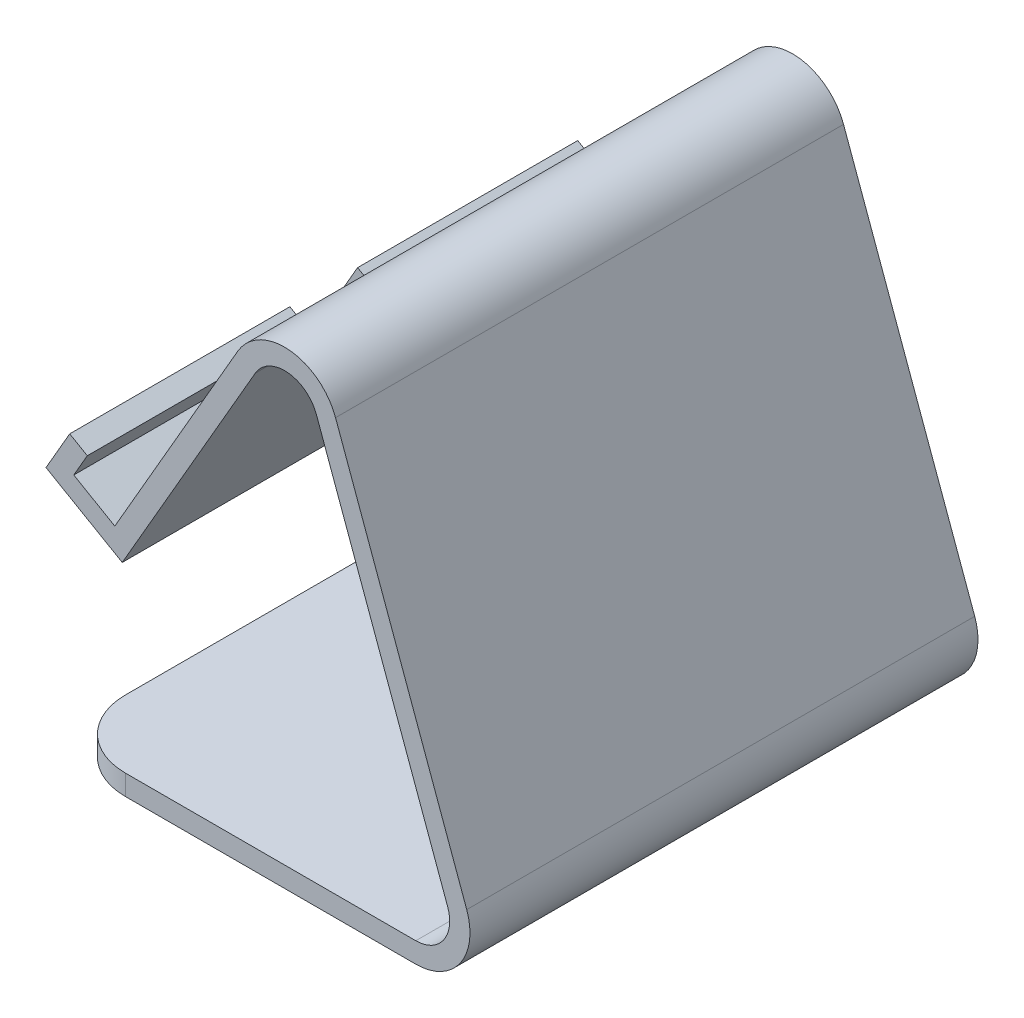
ISO-10303-21;
HEADER;
FILE_DESCRIPTION(('STEP AP214'),'2;1');
FILE_NAME('part.step','',(''),(''),'','','');
FILE_SCHEMA(('AUTOMOTIVE_DESIGN { 1 0 10303 214 1 1 1 1 }'));
ENDSEC;
DATA;
#1=APPLICATION_CONTEXT('core data for automotive mechanical design processes');
#2=APPLICATION_PROTOCOL_DEFINITION('international standard','automotive_design',2000,#1);
#3=PRODUCT_CONTEXT('',#1,'mechanical');
#4=PRODUCT('Part','Part','',(#3));
#5=PRODUCT_RELATED_PRODUCT_CATEGORY('part','',(#4));
#6=PRODUCT_DEFINITION_FORMATION('','',#4);
#7=PRODUCT_DEFINITION_CONTEXT('part definition',#1,'design');
#8=PRODUCT_DEFINITION('design','',#6,#7);
#9=PRODUCT_DEFINITION_SHAPE('','',#8);
#10=(LENGTH_UNIT() NAMED_UNIT(*) SI_UNIT(.MILLI.,.METRE.));
#11=(NAMED_UNIT(*) PLANE_ANGLE_UNIT() SI_UNIT($,.RADIAN.));
#12=(NAMED_UNIT(*) SI_UNIT($,.STERADIAN.) SOLID_ANGLE_UNIT());
#13=UNCERTAINTY_MEASURE_WITH_UNIT(LENGTH_MEASURE(1.E-05),#10,'distance_accuracy_value','');
#14=(GEOMETRIC_REPRESENTATION_CONTEXT(3) GLOBAL_UNCERTAINTY_ASSIGNED_CONTEXT((#13)) GLOBAL_UNIT_ASSIGNED_CONTEXT((#10,
#11,#12)) REPRESENTATION_CONTEXT('',''));
#15=CARTESIAN_POINT('',(0.,0.,0.));
#16=DIRECTION('',(0.,0.,1.));
#17=DIRECTION('',(1.,0.,0.));
#18=AXIS2_PLACEMENT_3D('',#15,#16,#17);
#19=CARTESIAN_POINT('',(8.42400739001227,30.7968060221313,37.5));
#20=DIRECTION('',(-0.5,-0.866025403784439,0.));
#21=DIRECTION('',(0.866025403784439,-0.5,0.));
#22=AXIS2_PLACEMENT_3D('',#19,#20,#21);
#23=PLANE('',#22);
#24=DIRECTION('',(0.,0.,-1.));
#25=VECTOR('',#24,1.);
#26=CARTESIAN_POINT('',(8.42400739001227,30.7968060221313,37.5));
#27=LINE('',#26,#25);
#28=CARTESIAN_POINT('',(8.42400739001227,30.7968060221313,37.5));
#29=VERTEX_POINT('',#28);
#30=CARTESIAN_POINT('',(8.42400739001227,30.7968060221313,5.));
#31=VERTEX_POINT('',#30);
#32=EDGE_CURVE('E464',#29,#31,#27,.T.);
#33=ORIENTED_EDGE('',*,*,#32,.T.);
#34=DIRECTION('',(-0.866025403784439,0.5,0.));
#35=VECTOR('',#34,1.);
#36=CARTESIAN_POINT('',(8.42400739001227,30.7968060221313,5.));
#37=LINE('',#36,#35);
#38=CARTESIAN_POINT('',(2.36182956352154,34.2968060221311,5.));
#39=VERTEX_POINT('',#38);
#40=EDGE_CURVE('E313',#31,#39,#37,.T.);
#41=ORIENTED_EDGE('',*,*,#40,.T.);
#42=DIRECTION('',(0.,0.,-1.));
#43=VECTOR('',#42,1.);
#44=CARTESIAN_POINT('',(2.36182956352154,34.2968060221311,37.5));
#45=LINE('',#44,#43);
#46=CARTESIAN_POINT('',(2.36182956352154,34.2968060221311,37.5));
#47=VERTEX_POINT('',#46);
#48=EDGE_CURVE('E459',#47,#39,#45,.T.);
#49=ORIENTED_EDGE('',*,*,#48,.F.);
#50=DIRECTION('',(-0.866025403784439,0.5,0.));
#51=VECTOR('',#50,1.);
#52=CARTESIAN_POINT('',(8.42400739001227,30.7968060221313,37.5));
#53=LINE('',#52,#51);
#54=EDGE_CURVE('E338',#29,#47,#53,.T.);
#55=ORIENTED_EDGE('',*,*,#54,.F.);
#56=EDGE_LOOP('',(#33,#41,#49,#55));
#57=FACE_BOUND('',#56,.T.);
#58=ADVANCED_FACE('F45',(#57),#23,.F.);
#59=CARTESIAN_POINT('',(2.36182956352154,34.2968060221311,37.5));
#60=DIRECTION('',(-0.866025403784438,0.5,0.));
#61=DIRECTION('',(-0.5,-0.866025403784439,0.));
#62=AXIS2_PLACEMENT_3D('',#59,#60,#61);
#63=PLANE('',#62);
#64=ORIENTED_EDGE('',*,*,#48,.T.);
#65=DIRECTION('',(0.5,0.866025403784439,0.));
#66=VECTOR('',#65,1.);
#67=CARTESIAN_POINT('',(2.36182956352154,34.2968060221311,5.));
#68=LINE('',#67,#66);
#69=CARTESIAN_POINT('',(4.36182956352148,37.7609076372688,5.));
#70=VERTEX_POINT('',#69);
#71=EDGE_CURVE('E309',#39,#70,#68,.T.);
#72=ORIENTED_EDGE('',*,*,#71,.T.);
#73=DIRECTION('',(0.,0.,-1.));
#74=VECTOR('',#73,1.);
#75=CARTESIAN_POINT('',(4.36182956352148,37.7609076372688,37.5));
#76=LINE('',#75,#74);
#77=CARTESIAN_POINT('',(4.36182956352148,37.7609076372688,37.5));
#78=VERTEX_POINT('',#77);
#79=EDGE_CURVE('E454',#78,#70,#76,.T.);
#80=ORIENTED_EDGE('',*,*,#79,.F.);
#81=DIRECTION('',(0.5,0.866025403784439,0.));
#82=VECTOR('',#81,1.);
#83=CARTESIAN_POINT('',(2.36182956352154,34.2968060221311,37.5));
#84=LINE('',#83,#82);
#85=EDGE_CURVE('E341',#47,#78,#84,.T.);
#86=ORIENTED_EDGE('',*,*,#85,.F.);
#87=EDGE_LOOP('',(#64,#72,#80,#86));
#88=FACE_BOUND('',#87,.T.);
#89=ADVANCED_FACE('F546',(#88),#63,.F.);
#90=CARTESIAN_POINT('',(1.7637533521681,39.2609076372688,37.5));
#91=DIRECTION('',(-0.500000000000001,-0.866025403784438,0.));
#92=DIRECTION('',(0.866025403784438,-0.500000000000001,0.));
#93=AXIS2_PLACEMENT_3D('',#90,#91,#92);
#94=PLANE('',#93);
#95=ORIENTED_EDGE('',*,*,#79,.T.);
#96=DIRECTION('',(-0.866025403784438,0.500000000000001,0.));
#97=VECTOR('',#96,1.);
#98=CARTESIAN_POINT('',(1.7637533521681,39.2609076372688,5.));
#99=LINE('',#98,#97);
#100=CARTESIAN_POINT('',(1.76375335216811,39.2609076372688,5.));
#101=VERTEX_POINT('',#100);
#102=EDGE_CURVE('E305',#70,#101,#99,.T.);
#103=ORIENTED_EDGE('',*,*,#102,.T.);
#104=DIRECTION('',(0.,0.,-1.));
#105=VECTOR('',#104,1.);
#106=CARTESIAN_POINT('',(1.7637533521681,39.2609076372688,37.5));
#107=LINE('',#106,#105);
#108=CARTESIAN_POINT('',(1.7637533521681,39.2609076372688,37.5));
#109=VERTEX_POINT('',#108);
#110=EDGE_CURVE('E449',#109,#101,#107,.T.);
#111=ORIENTED_EDGE('',*,*,#110,.F.);
#112=DIRECTION('',(-0.866025403784438,0.500000000000001,0.));
#113=VECTOR('',#112,1.);
#114=CARTESIAN_POINT('',(1.7637533521681,39.2609076372688,37.5));
#115=LINE('',#114,#113);
#116=EDGE_CURVE('E344',#78,#109,#115,.T.);
#117=ORIENTED_EDGE('',*,*,#116,.F.);
#118=EDGE_LOOP('',(#95,#103,#111,#117));
#119=FACE_BOUND('',#118,.T.);
#120=ADVANCED_FACE('F554',(#119),#94,.F.);
#121=CARTESIAN_POINT('',(-1.73624664783184,33.1987298107777,37.5));
#122=DIRECTION('',(0.866025403784443,-0.499999999999992,0.));
#123=DIRECTION('',(0.499999999999992,0.866025403784443,0.));
#124=AXIS2_PLACEMENT_3D('',#121,#122,#123);
#125=PLANE('',#124);
#126=ORIENTED_EDGE('',*,*,#110,.T.);
#127=DIRECTION('',(0.499999999999992,0.866025403784443,0.));
#128=VECTOR('',#127,1.);
#129=CARTESIAN_POINT('',(2.01375335216811,39.693920339161,5.));
#130=LINE('',#129,#128);
#131=CARTESIAN_POINT('',(-1.73624664783183,33.1987298107777,5.));
#132=VERTEX_POINT('',#131);
#133=EDGE_CURVE('E262',#132,#101,#130,.T.);
#134=ORIENTED_EDGE('',*,*,#133,.F.);
#135=DIRECTION('',(0.,0.,-1.));
#136=VECTOR('',#135,1.);
#137=CARTESIAN_POINT('',(-1.73624664783184,33.1987298107777,37.5));
#138=LINE('',#137,#136);
#139=CARTESIAN_POINT('',(-1.73624664783184,33.1987298107777,37.5));
#140=VERTEX_POINT('',#139);
#141=EDGE_CURVE('E444',#140,#132,#138,.T.);
#142=ORIENTED_EDGE('',*,*,#141,.F.);
#143=DIRECTION('',(-0.499999999999992,-0.866025403784443,0.));
#144=VECTOR('',#143,1.);
#145=CARTESIAN_POINT('',(-1.73624664783184,33.1987298107777,37.5));
#146=LINE('',#145,#144);
#147=EDGE_CURVE('E347',#109,#140,#146,.T.);
#148=ORIENTED_EDGE('',*,*,#147,.F.);
#149=EDGE_LOOP('',(#126,#134,#142,#148));
#150=FACE_BOUND('',#149,.T.);
#151=ADVANCED_FACE('F617',(#150),#125,.F.);
#152=CARTESIAN_POINT('',(9.52208360136593,26.6987298107778,37.5));
#153=DIRECTION('',(0.499999999999992,0.866025403784443,0.));
#154=DIRECTION('',(-0.866025403784444,0.499999999999992,0.));
#155=AXIS2_PLACEMENT_3D('',#152,#153,#154);
#156=PLANE('',#155);
#157=ORIENTED_EDGE('',*,*,#141,.T.);
#158=DIRECTION('',(0.866025403784444,-0.499999999999992,0.));
#159=VECTOR('',#158,1.);
#160=CARTESIAN_POINT('',(9.52208360136593,26.6987298107778,5.));
#161=LINE('',#160,#159);
#162=CARTESIAN_POINT('',(9.52208360136593,26.6987298107778,4.99999999999999));
#163=VERTEX_POINT('',#162);
#164=EDGE_CURVE('E301',#132,#163,#161,.T.);
#165=ORIENTED_EDGE('',*,*,#164,.T.);
#166=DIRECTION('',(0.,0.,-1.));
#167=VECTOR('',#166,1.);
#168=CARTESIAN_POINT('',(9.52208360136593,26.6987298107778,37.5));
#169=LINE('',#168,#167);
#170=CARTESIAN_POINT('',(9.52208360136593,26.6987298107778,37.5));
#171=VERTEX_POINT('',#170);
#172=EDGE_CURVE('E439',#171,#163,#169,.T.);
#173=ORIENTED_EDGE('',*,*,#172,.F.);
#174=DIRECTION('',(0.866025403784444,-0.499999999999992,0.));
#175=VECTOR('',#174,1.);
#176=CARTESIAN_POINT('',(9.52208360136593,26.6987298107778,37.5));
#177=LINE('',#176,#175);
#178=EDGE_CURVE('E350',#140,#171,#177,.T.);
#179=ORIENTED_EDGE('',*,*,#178,.F.);
#180=EDGE_LOOP('',(#157,#165,#173,#179));
#181=FACE_BOUND('',#180,.T.);
#182=ADVANCED_FACE('F610',(#181),#156,.F.);
#183=CARTESIAN_POINT('',(0.,0.,37.5));
#184=DIRECTION('',(1.,0.,0.));
#185=DIRECTION('',(0.,0.,-1.));
#186=AXIS2_PLACEMENT_3D('',#183,#184,#185);
#187=PLANE('',#186);
#188=DIRECTION('',(0.,0.,-1.));
#189=VECTOR('',#188,1.);
#190=CARTESIAN_POINT('',(0.,-3.,37.5));
#191=LINE('',#190,#189);
#192=CARTESIAN_POINT('',(0.,-3.,27.5));
#193=VERTEX_POINT('',#192);
#194=CARTESIAN_POINT('',(0.,-3.,-27.5));
#195=VERTEX_POINT('',#194);
#196=EDGE_CURVE('E484',#193,#195,#191,.T.);
#197=ORIENTED_EDGE('',*,*,#196,.F.);
#198=DIRECTION('',(0.,-1.,0.));
#199=VECTOR('',#198,1.);
#200=CARTESIAN_POINT('',(0.,0.,27.5));
#201=LINE('',#200,#199);
#202=CARTESIAN_POINT('',(0.,0.,27.5));
#203=VERTEX_POINT('',#202);
#204=EDGE_CURVE('E520',#193,#203,#201,.F.);
#205=ORIENTED_EDGE('',*,*,#204,.T.);
#206=DIRECTION('',(0.,0.,-1.));
#207=VECTOR('',#206,1.);
#208=CARTESIAN_POINT('',(0.,0.,37.5));
#209=LINE('',#208,#207);
#210=CARTESIAN_POINT('',(0.,0.,-27.5));
#211=VERTEX_POINT('',#210);
#212=EDGE_CURVE('E369',#203,#211,#209,.T.);
#213=ORIENTED_EDGE('',*,*,#212,.T.);
#214=DIRECTION('',(0.,-1.,0.));
#215=VECTOR('',#214,1.);
#216=CARTESIAN_POINT('',(0.,0.,-27.5));
#217=LINE('',#216,#215);
#218=EDGE_CURVE('E499',#211,#195,#217,.T.);
#219=ORIENTED_EDGE('',*,*,#218,.T.);
#220=EDGE_LOOP('',(#197,#205,#213,#219));
#221=FACE_BOUND('',#220,.T.);
#222=ADVANCED_FACE('F651',(#221),#187,.F.);
#223=CARTESIAN_POINT('',(0.,-3.,37.5));
#224=DIRECTION('',(0.,1.,0.));
#225=DIRECTION('',(0.,0.,1.));
#226=AXIS2_PLACEMENT_3D('',#223,#224,#225);
#227=PLANE('',#226);
#228=DIRECTION('',(1.,0.,0.));
#229=VECTOR('',#228,1.);
#230=CARTESIAN_POINT('',(0.,-3.,37.5));
#231=LINE('',#230,#229);
#232=CARTESIAN_POINT('',(10.,-3.,37.5));
#233=VERTEX_POINT('',#232);
#234=CARTESIAN_POINT('',(52.8592599662893,-3.,37.5));
#235=VERTEX_POINT('',#234);
#236=EDGE_CURVE('E322',#233,#235,#231,.T.);
#237=ORIENTED_EDGE('',*,*,#236,.F.);
#238=CARTESIAN_POINT('',(10.,-3.,27.5));
#239=DIRECTION('',(0.,1.,0.));
#240=DIRECTION('',(0.,0.,1.));
#241=AXIS2_PLACEMENT_3D('',#238,#239,#240);
#242=CIRCLE('',#241,10.);
#243=EDGE_CURVE('E517',#233,#193,#242,.F.);
#244=ORIENTED_EDGE('',*,*,#243,.T.);
#245=ORIENTED_EDGE('',*,*,#196,.T.);
#246=CARTESIAN_POINT('',(10.,-3.,-27.5));
#247=DIRECTION('',(0.,1.,0.));
#248=DIRECTION('',(0.,0.,1.));
#249=AXIS2_PLACEMENT_3D('',#246,#247,#248);
#250=CIRCLE('',#249,10.);
#251=CARTESIAN_POINT('',(10.,-3.,-37.5));
#252=VERTEX_POINT('',#251);
#253=EDGE_CURVE('E503',#195,#252,#250,.F.);
#254=ORIENTED_EDGE('',*,*,#253,.T.);
#255=DIRECTION('',(1.,0.,0.));
#256=VECTOR('',#255,1.);
#257=CARTESIAN_POINT('',(0.,-3.,-37.5));
#258=LINE('',#257,#256);
#259=CARTESIAN_POINT('',(52.8592599662893,-3.,-37.5));
#260=VERTEX_POINT('',#259);
#261=EDGE_CURVE('E321',#252,#260,#258,.T.);
#262=ORIENTED_EDGE('',*,*,#261,.T.);
#263=DIRECTION('',(0.,0.,-1.));
#264=VECTOR('',#263,1.);
#265=CARTESIAN_POINT('',(52.8592599662893,-3.,37.5));
#266=LINE('',#265,#264);
#267=EDGE_CURVE('E480',#235,#260,#266,.T.);
#268=ORIENTED_EDGE('',*,*,#267,.F.);
#269=EDGE_LOOP('',(#237,#244,#245,#254,#262,#268));
#270=FACE_BOUND('',#269,.T.);
#271=ADVANCED_FACE('F706',(#270),#227,.F.);
#272=CARTESIAN_POINT('',(52.8592599662894,5.,37.5));
#273=DIRECTION('',(0.,0.,-1.));
#274=DIRECTION('',(-1.,0.,0.));
#275=AXIS2_PLACEMENT_3D('',#272,#273,#274);
#276=CYLINDRICAL_SURFACE('',#275,8.);
#277=CARTESIAN_POINT('',(52.8592599662894,5.,-37.5));
#278=DIRECTION('',(0.,0.,1.));
#279=DIRECTION('',(1.,0.,0.));
#280=AXIS2_PLACEMENT_3D('',#277,#278,#279);
#281=CIRCLE('',#280,8.);
#282=CARTESIAN_POINT('',(60.3768009325766,7.73616114660545,-37.5));
#283=VERTEX_POINT('',#282);
#284=EDGE_CURVE('E372',#260,#283,#281,.T.);
#285=ORIENTED_EDGE('',*,*,#284,.T.);
#286=DIRECTION('',(0.,0.,-1.));
#287=VECTOR('',#286,1.);
#288=CARTESIAN_POINT('',(60.3768009325766,7.73616114660545,37.5));
#289=LINE('',#288,#287);
#290=CARTESIAN_POINT('',(60.3768009325766,7.73616114660545,37.5));
#291=VERTEX_POINT('',#290);
#292=EDGE_CURVE('E476',#291,#283,#289,.T.);
#293=ORIENTED_EDGE('',*,*,#292,.F.);
#294=CARTESIAN_POINT('',(52.8592599662894,5.,37.5));
#295=DIRECTION('',(0.,0.,1.));
#296=DIRECTION('',(1.,0.,0.));
#297=AXIS2_PLACEMENT_3D('',#294,#295,#296);
#298=CIRCLE('',#297,8.);
#299=EDGE_CURVE('E325',#235,#291,#298,.T.);
#300=ORIENTED_EDGE('',*,*,#299,.F.);
#301=ORIENTED_EDGE('',*,*,#267,.T.);
#302=EDGE_LOOP('',(#285,#293,#300,#301));
#303=FACE_BOUND('',#302,.T.);
#304=ADVANCED_FACE('F714',(#303),#276,.T.);
#305=CARTESIAN_POINT('',(60.3768009325766,7.73616114660545,37.5));
#306=DIRECTION('',(-0.939692620785907,-0.342020143325673,0.));
#307=DIRECTION('',(0.342020143325673,-0.939692620785907,0.));
#308=AXIS2_PLACEMENT_3D('',#305,#306,#307);
#309=PLANE('',#308);
#310=DIRECTION('',(-0.342020143325673,0.939692620785907,0.));
#311=VECTOR('',#310,1.);
#312=CARTESIAN_POINT('',(60.3768009325766,7.73616114660545,-37.5));
#313=LINE('',#312,#311);
#314=CARTESIAN_POINT('',(41.0084842853011,60.9501737878412,-37.5));
#315=VERTEX_POINT('',#314);
#316=EDGE_CURVE('E375',#283,#315,#313,.T.);
#317=ORIENTED_EDGE('',*,*,#316,.T.);
#318=DIRECTION('',(0.,0.,-1.));
#319=VECTOR('',#318,1.);
#320=CARTESIAN_POINT('',(41.0084842853011,60.9501737878412,37.5));
#321=LINE('',#320,#319);
#322=CARTESIAN_POINT('',(41.0084842853011,60.9501737878412,37.5));
#323=VERTEX_POINT('',#322);
#324=EDGE_CURVE('E472',#323,#315,#321,.T.);
#325=ORIENTED_EDGE('',*,*,#324,.F.);
#326=DIRECTION('',(-0.342020143325673,0.939692620785907,0.));
#327=VECTOR('',#326,1.);
#328=CARTESIAN_POINT('',(60.3768009325766,7.73616114660545,37.5));
#329=LINE('',#328,#327);
#330=EDGE_CURVE('E329',#291,#323,#329,.T.);
#331=ORIENTED_EDGE('',*,*,#330,.F.);
#332=ORIENTED_EDGE('',*,*,#292,.T.);
#333=EDGE_LOOP('',(#317,#325,#331,#332));
#334=FACE_BOUND('',#333,.T.);
#335=ADVANCED_FACE('F823',(#334),#309,.F.);
#336=CARTESIAN_POINT('',(33.4909433190139,58.2140126412359,37.5));
#337=DIRECTION('',(0.,0.,-1.));
#338=DIRECTION('',(-1.,0.,0.));
#339=AXIS2_PLACEMENT_3D('',#336,#337,#338);
#340=CYLINDRICAL_SURFACE('',#339,8.);
#341=CARTESIAN_POINT('',(33.4909433190139,58.2140126412359,-37.5));
#342=DIRECTION('',(0.,0.,1.));
#343=DIRECTION('',(1.,0.,0.));
#344=AXIS2_PLACEMENT_3D('',#341,#342,#343);
#345=CIRCLE('',#344,8.);
#346=CARTESIAN_POINT('',(26.5627400887383,62.2140126412358,-37.5));
#347=VERTEX_POINT('',#346);
#348=EDGE_CURVE('E378',#315,#347,#345,.T.);
#349=ORIENTED_EDGE('',*,*,#348,.T.);
#350=DIRECTION('',(0.,0.,-1.));
#351=VECTOR('',#350,1.);
#352=CARTESIAN_POINT('',(26.5627400887383,62.2140126412358,37.5));
#353=LINE('',#352,#351);
#354=CARTESIAN_POINT('',(26.5627400887383,62.2140126412358,37.5));
#355=VERTEX_POINT('',#354);
#356=EDGE_CURVE('E468',#355,#347,#353,.T.);
#357=ORIENTED_EDGE('',*,*,#356,.F.);
#358=CARTESIAN_POINT('',(33.4909433190139,58.2140126412359,37.5));
#359=DIRECTION('',(0.,0.,1.));
#360=DIRECTION('',(1.,0.,0.));
#361=AXIS2_PLACEMENT_3D('',#358,#359,#360);
#362=CIRCLE('',#361,8.);
#363=EDGE_CURVE('E332',#323,#355,#362,.T.);
#364=ORIENTED_EDGE('',*,*,#363,.F.);
#365=ORIENTED_EDGE('',*,*,#324,.T.);
#366=EDGE_LOOP('',(#349,#357,#364,#365));
#367=FACE_BOUND('',#366,.T.);
#368=ADVANCED_FACE('F568',(#367),#340,.T.);
#369=CARTESIAN_POINT('',(26.5627400887383,62.2140126412358,37.5));
#370=DIRECTION('',(0.866025403784438,-0.5,0.));
#371=DIRECTION('',(0.5,0.866025403784439,0.));
#372=AXIS2_PLACEMENT_3D('',#369,#370,#371);
#373=PLANE('',#372);
#374=DIRECTION('',(-0.413696277628415,-0.716542971754534,-0.561624037506921));
#375=VECTOR('',#374,1.);
#376=CARTESIAN_POINT('',(22.5088793147639,55.1925198139015,-1.34188309076047));
#377=LINE('',#376,#375);
#378=CARTESIAN_POINT('',(22.5088793147639,55.1925198139016,-1.34188309076047));
#379=VERTEX_POINT('',#378);
#380=CARTESIAN_POINT('',(15.589794628021,43.2083135945912,-10.7350647260837));
#381=VERTEX_POINT('',#380);
#382=EDGE_CURVE('E248',#379,#381,#377,.T.);
#383=ORIENTED_EDGE('',*,*,#382,.F.);
#384=DIRECTION('',(0.440064156251529,0.762213477217576,-0.474735877652534));
#385=VECTOR('',#384,1.);
#386=CARTESIAN_POINT('',(22.5088793147639,55.1925198139015,-1.34188309076047));
#387=LINE('',#386,#385);
#388=CARTESIAN_POINT('',(15.589794628021,43.2083135945912,6.12234160159461));
#389=VERTEX_POINT('',#388);
#390=EDGE_CURVE('E61',#389,#379,#387,.T.);
#391=ORIENTED_EDGE('',*,*,#390,.F.);
#392=DIRECTION('',(0.,0.,1.));
#393=VECTOR('',#392,1.);
#394=CARTESIAN_POINT('',(15.589794628021,43.2083135945912,6.12234160159461));
#395=LINE('',#394,#393);
#396=EDGE_CURVE('E240',#381,#389,#395,.T.);
#397=ORIENTED_EDGE('',*,*,#396,.F.);
#398=EDGE_LOOP('',(#383,#391,#397));
#399=FACE_BOUND('',#398,.T.);
#400=DIRECTION('',(0.,0.,1.));
#401=VECTOR('',#400,1.);
#402=CARTESIAN_POINT('',(10.6740073900123,34.6939203391613,37.5));
#403=LINE('',#402,#401);
#404=CARTESIAN_POINT('',(10.6740073900123,34.6939203391613,-5.));
#405=VERTEX_POINT('',#404);
#406=CARTESIAN_POINT('',(10.6740073900123,34.6939203391613,5.));
#407=VERTEX_POINT('',#406);
#408=EDGE_CURVE('E274',#405,#407,#403,.T.);
#409=ORIENTED_EDGE('',*,*,#408,.T.);
#410=DIRECTION('',(-0.5,-0.866025403784439,0.));
#411=VECTOR('',#410,1.);
#412=CARTESIAN_POINT('',(26.5627400887383,62.2140126412358,4.99999999999999));
#413=LINE('',#412,#411);
#414=EDGE_CURVE('E317',#407,#31,#413,.T.);
#415=ORIENTED_EDGE('',*,*,#414,.T.);
#416=ORIENTED_EDGE('',*,*,#32,.F.);
#417=DIRECTION('',(-0.5,-0.866025403784438,0.));
#418=VECTOR('',#417,1.);
#419=CARTESIAN_POINT('',(26.5627400887383,62.2140126412358,37.5));
#420=LINE('',#419,#418);
#421=EDGE_CURVE('E335',#355,#29,#420,.T.);
#422=ORIENTED_EDGE('',*,*,#421,.F.);
#423=ORIENTED_EDGE('',*,*,#356,.T.);
#424=DIRECTION('',(-0.5,-0.866025403784438,0.));
#425=VECTOR('',#424,1.);
#426=CARTESIAN_POINT('',(26.5627400887383,62.2140126412358,-37.5));
#427=LINE('',#426,#425);
#428=CARTESIAN_POINT('',(8.42400739001227,30.7968060221313,-37.5));
#429=VERTEX_POINT('',#428);
#430=EDGE_CURVE('E381',#347,#429,#427,.T.);
#431=ORIENTED_EDGE('',*,*,#430,.T.);
#432=CARTESIAN_POINT('',(8.42400739001227,30.7968060221313,-5.));
#433=VERTEX_POINT('',#432);
#434=EDGE_CURVE('E463',#433,#429,#27,.T.);
#435=ORIENTED_EDGE('',*,*,#434,.F.);
#436=DIRECTION('',(0.5,0.866025403784439,0.));
#437=VECTOR('',#436,1.);
#438=CARTESIAN_POINT('',(26.5627400887383,62.2140126412358,-5.));
#439=LINE('',#438,#437);
#440=EDGE_CURVE('E297',#433,#405,#439,.T.);
#441=ORIENTED_EDGE('',*,*,#440,.T.);
#442=EDGE_LOOP('',(#409,#415,#416,#422,#423,#431,#435,#441));
#443=FACE_BOUND('',#442,.T.);
#444=ADVANCED_FACE('F253',(#399,#443),#373,.F.);
#445=CARTESIAN_POINT('',(2.36182956352154,34.2968060221311,-5.));
#446=VERTEX_POINT('',#445);
#447=CARTESIAN_POINT('',(2.36182956352154,34.2968060221311,-37.5));
#448=VERTEX_POINT('',#447);
#449=EDGE_CURVE('E458',#446,#448,#45,.T.);
#450=ORIENTED_EDGE('',*,*,#449,.F.);
#451=DIRECTION('',(0.866025403784439,-0.5,0.));
#452=VECTOR('',#451,1.);
#453=CARTESIAN_POINT('',(8.42400739001227,30.7968060221313,-5.));
#454=LINE('',#453,#452);
#455=EDGE_CURVE('E293',#446,#433,#454,.T.);
#456=ORIENTED_EDGE('',*,*,#455,.T.);
#457=ORIENTED_EDGE('',*,*,#434,.T.);
#458=DIRECTION('',(-0.866025403784439,0.5,0.));
#459=VECTOR('',#458,1.);
#460=CARTESIAN_POINT('',(8.42400739001227,30.7968060221313,-37.5));
#461=LINE('',#460,#459);
#462=EDGE_CURVE('E385',#429,#448,#461,.T.);
#463=ORIENTED_EDGE('',*,*,#462,.T.);
#464=EDGE_LOOP('',(#450,#456,#457,#463));
#465=FACE_BOUND('',#464,.T.);
#466=ADVANCED_FACE('F549',(#465),#23,.F.);
#467=CARTESIAN_POINT('',(4.36182956352148,37.7609076372688,-5.));
#468=VERTEX_POINT('',#467);
#469=CARTESIAN_POINT('',(4.36182956352148,37.7609076372688,-37.5));
#470=VERTEX_POINT('',#469);
#471=EDGE_CURVE('E453',#468,#470,#76,.T.);
#472=ORIENTED_EDGE('',*,*,#471,.F.);
#473=DIRECTION('',(-0.5,-0.866025403784439,0.));
#474=VECTOR('',#473,1.);
#475=CARTESIAN_POINT('',(2.36182956352154,34.2968060221311,-5.));
#476=LINE('',#475,#474);
#477=EDGE_CURVE('E289',#468,#446,#476,.T.);
#478=ORIENTED_EDGE('',*,*,#477,.T.);
#479=ORIENTED_EDGE('',*,*,#449,.T.);
#480=DIRECTION('',(0.5,0.866025403784439,0.));
#481=VECTOR('',#480,1.);
#482=CARTESIAN_POINT('',(2.36182956352154,34.2968060221311,-37.5));
#483=LINE('',#482,#481);
#484=EDGE_CURVE('E389',#448,#470,#483,.T.);
#485=ORIENTED_EDGE('',*,*,#484,.T.);
#486=EDGE_LOOP('',(#472,#478,#479,#485));
#487=FACE_BOUND('',#486,.T.);
#488=ADVANCED_FACE('F557',(#487),#63,.F.);
#489=CARTESIAN_POINT('',(1.76375335216811,39.2609076372688,-5.));
#490=VERTEX_POINT('',#489);
#491=CARTESIAN_POINT('',(1.7637533521681,39.2609076372688,-37.5));
#492=VERTEX_POINT('',#491);
#493=EDGE_CURVE('E448',#490,#492,#107,.T.);
#494=ORIENTED_EDGE('',*,*,#493,.F.);
#495=DIRECTION('',(0.866025403784438,-0.500000000000001,0.));
#496=VECTOR('',#495,1.);
#497=CARTESIAN_POINT('',(1.7637533521681,39.2609076372688,-5.));
#498=LINE('',#497,#496);
#499=EDGE_CURVE('E285',#490,#468,#498,.T.);
#500=ORIENTED_EDGE('',*,*,#499,.T.);
#501=ORIENTED_EDGE('',*,*,#471,.T.);
#502=DIRECTION('',(-0.866025403784438,0.500000000000001,0.));
#503=VECTOR('',#502,1.);
#504=CARTESIAN_POINT('',(1.7637533521681,39.2609076372688,-37.5));
#505=LINE('',#504,#503);
#506=EDGE_CURVE('E393',#470,#492,#505,.T.);
#507=ORIENTED_EDGE('',*,*,#506,.T.);
#508=EDGE_LOOP('',(#494,#500,#501,#507));
#509=FACE_BOUND('',#508,.T.);
#510=ADVANCED_FACE('F565',(#509),#94,.F.);
#511=CARTESIAN_POINT('',(-1.73624664783183,33.1987298107777,-5.));
#512=VERTEX_POINT('',#511);
#513=CARTESIAN_POINT('',(-1.73624664783184,33.1987298107777,-37.5));
#514=VERTEX_POINT('',#513);
#515=EDGE_CURVE('E443',#512,#514,#138,.T.);
#516=ORIENTED_EDGE('',*,*,#515,.F.);
#517=DIRECTION('',(-0.499999999999992,-0.866025403784443,0.));
#518=VECTOR('',#517,1.);
#519=CARTESIAN_POINT('',(2.01375335216811,39.693920339161,-5.));
#520=LINE('',#519,#518);
#521=EDGE_CURVE('E266',#490,#512,#520,.T.);
#522=ORIENTED_EDGE('',*,*,#521,.F.);
#523=ORIENTED_EDGE('',*,*,#493,.T.);
#524=DIRECTION('',(-0.499999999999992,-0.866025403784443,0.));
#525=VECTOR('',#524,1.);
#526=CARTESIAN_POINT('',(-1.73624664783184,33.1987298107777,-37.5));
#527=LINE('',#526,#525);
#528=EDGE_CURVE('E397',#492,#514,#527,.T.);
#529=ORIENTED_EDGE('',*,*,#528,.T.);
#530=EDGE_LOOP('',(#516,#522,#523,#529));
#531=FACE_BOUND('',#530,.T.);
#532=ADVANCED_FACE('F634',(#531),#125,.F.);
#533=CARTESIAN_POINT('',(9.52208360136593,26.6987298107778,-5.));
#534=VERTEX_POINT('',#533);
#535=CARTESIAN_POINT('',(9.52208360136593,26.6987298107778,-37.5));
#536=VERTEX_POINT('',#535);
#537=EDGE_CURVE('E438',#534,#536,#169,.T.);
#538=ORIENTED_EDGE('',*,*,#537,.F.);
#539=DIRECTION('',(-0.866025403784444,0.499999999999992,0.));
#540=VECTOR('',#539,1.);
#541=CARTESIAN_POINT('',(9.52208360136593,26.6987298107778,-5.));
#542=LINE('',#541,#540);
#543=EDGE_CURVE('E281',#534,#512,#542,.T.);
#544=ORIENTED_EDGE('',*,*,#543,.T.);
#545=ORIENTED_EDGE('',*,*,#515,.T.);
#546=DIRECTION('',(0.866025403784444,-0.499999999999992,0.));
#547=VECTOR('',#546,1.);
#548=CARTESIAN_POINT('',(9.52208360136593,26.6987298107778,-37.5));
#549=LINE('',#548,#547);
#550=EDGE_CURVE('E401',#514,#536,#549,.T.);
#551=ORIENTED_EDGE('',*,*,#550,.T.);
#552=EDGE_LOOP('',(#538,#544,#545,#551));
#553=FACE_BOUND('',#552,.T.);
#554=ADVANCED_FACE('F585',(#553),#156,.F.);
#555=CARTESIAN_POINT('',(29.1608163000917,60.7140126412358,37.5));
#556=DIRECTION('',(-0.866025403784444,0.499999999999991,0.));
#557=DIRECTION('',(-0.499999999999991,-0.866025403784444,0.));
#558=AXIS2_PLACEMENT_3D('',#555,#556,#557);
#559=PLANE('',#558);
#560=DIRECTION('',(0.,0.,1.));
#561=VECTOR('',#560,1.);
#562=CARTESIAN_POINT('',(18.1878708393746,41.7083135945911,37.5));
#563=LINE('',#562,#561);
#564=CARTESIAN_POINT('',(18.1878708393745,41.7083135945911,-10.7350647260837));
#565=VERTEX_POINT('',#564);
#566=CARTESIAN_POINT('',(18.1878708393746,41.7083135945911,6.12234160159461));
#567=VERTEX_POINT('',#566);
#568=EDGE_CURVE('E54',#565,#567,#563,.T.);
#569=ORIENTED_EDGE('',*,*,#568,.T.);
#570=DIRECTION('',(0.440064156251521,0.762213477217581,-0.474735877652534));
#571=VECTOR('',#570,1.);
#572=CARTESIAN_POINT('',(20.1325582398777,45.0766109771016,4.02443640590309));
#573=LINE('',#572,#571);
#574=CARTESIAN_POINT('',(25.1069555261173,53.6925198139015,-1.34188309076047));
#575=VERTEX_POINT('',#574);
#576=EDGE_CURVE('E11',#567,#575,#573,.T.);
#577=ORIENTED_EDGE('',*,*,#576,.T.);
#578=DIRECTION('',(-0.413696277628407,-0.716542971754538,-0.561624037506921));
#579=VECTOR('',#578,1.);
#580=CARTESIAN_POINT('',(36.9067332255814,74.1303343073921,14.6772090587942));
#581=LINE('',#580,#579);
#582=EDGE_CURVE('E526',#575,#565,#581,.T.);
#583=ORIENTED_EDGE('',*,*,#582,.T.);
#584=EDGE_LOOP('',(#569,#577,#583));
#585=FACE_BOUND('',#584,.T.);
#586=ORIENTED_EDGE('',*,*,#172,.T.);
#587=DIRECTION('',(0.499999999999991,0.866025403784444,0.));
#588=VECTOR('',#587,1.);
#589=CARTESIAN_POINT('',(29.1608163000917,60.7140126412358,4.99999999999999));
#590=LINE('',#589,#588);
#591=CARTESIAN_POINT('',(13.2720836013659,33.1939203391612,5.));
#592=VERTEX_POINT('',#591);
#593=EDGE_CURVE('E495',#163,#592,#590,.T.);
#594=ORIENTED_EDGE('',*,*,#593,.T.);
#595=DIRECTION('',(0.,0.,-1.));
#596=VECTOR('',#595,1.);
#597=CARTESIAN_POINT('',(13.2720836013659,33.1939203391612,37.5));
#598=LINE('',#597,#596);
#599=CARTESIAN_POINT('',(13.2720836013659,33.1939203391612,-5.));
#600=VERTEX_POINT('',#599);
#601=EDGE_CURVE('E487',#592,#600,#598,.T.);
#602=ORIENTED_EDGE('',*,*,#601,.T.);
#603=DIRECTION('',(-0.499999999999991,-0.866025403784444,0.));
#604=VECTOR('',#603,1.);
#605=CARTESIAN_POINT('',(29.1608163000917,60.7140126412358,-5.));
#606=LINE('',#605,#604);
#607=EDGE_CURVE('E491',#600,#534,#606,.T.);
#608=ORIENTED_EDGE('',*,*,#607,.T.);
#609=ORIENTED_EDGE('',*,*,#537,.T.);
#610=DIRECTION('',(0.499999999999991,0.866025403784444,0.));
#611=VECTOR('',#610,1.);
#612=CARTESIAN_POINT('',(29.1608163000917,60.7140126412358,-37.5));
#613=LINE('',#612,#611);
#614=CARTESIAN_POINT('',(29.1608163000917,60.7140126412358,-37.5));
#615=VERTEX_POINT('',#614);
#616=EDGE_CURVE('E405',#536,#615,#613,.T.);
#617=ORIENTED_EDGE('',*,*,#616,.T.);
#618=DIRECTION('',(0.,0.,-1.));
#619=VECTOR('',#618,1.);
#620=CARTESIAN_POINT('',(29.1608163000917,60.7140126412358,37.5));
#621=LINE('',#620,#619);
#622=CARTESIAN_POINT('',(29.1608163000917,60.7140126412358,37.5));
#623=VERTEX_POINT('',#622);
#624=EDGE_CURVE('E434',#623,#615,#621,.T.);
#625=ORIENTED_EDGE('',*,*,#624,.F.);
#626=DIRECTION('',(0.499999999999991,0.866025403784444,0.));
#627=VECTOR('',#626,1.);
#628=CARTESIAN_POINT('',(29.1608163000917,60.7140126412358,37.5));
#629=LINE('',#628,#627);
#630=EDGE_CURVE('E353',#171,#623,#629,.T.);
#631=ORIENTED_EDGE('',*,*,#630,.F.);
#632=EDGE_LOOP('',(#586,#594,#602,#608,#609,#617,#625,#631));
#633=FACE_BOUND('',#632,.T.);
#634=ADVANCED_FACE('F530',(#585,#633),#559,.F.);
#635=CARTESIAN_POINT('',(33.4909433190139,58.2140126412359,37.5));
#636=DIRECTION('',(0.,0.,-1.));
#637=DIRECTION('',(-1.,0.,0.));
#638=AXIS2_PLACEMENT_3D('',#635,#636,#637);
#639=CYLINDRICAL_SURFACE('',#638,5.);
#640=CARTESIAN_POINT('',(33.4909433190139,58.2140126412359,-37.5));
#641=DIRECTION('',(0.,0.,-1.));
#642=DIRECTION('',(1.,0.,0.));
#643=AXIS2_PLACEMENT_3D('',#640,#641,#642);
#644=CIRCLE('',#643,5.);
#645=CARTESIAN_POINT('',(38.1894064229434,59.9241133578642,-37.5));
#646=VERTEX_POINT('',#645);
#647=EDGE_CURVE('E408',#615,#646,#644,.T.);
#648=ORIENTED_EDGE('',*,*,#647,.T.);
#649=DIRECTION('',(0.,0.,-1.));
#650=VECTOR('',#649,1.);
#651=CARTESIAN_POINT('',(38.1894064229434,59.9241133578642,37.5));
#652=LINE('',#651,#650);
#653=CARTESIAN_POINT('',(38.1894064229434,59.9241133578642,37.5));
#654=VERTEX_POINT('',#653);
#655=EDGE_CURVE('E430',#654,#646,#652,.T.);
#656=ORIENTED_EDGE('',*,*,#655,.F.);
#657=CARTESIAN_POINT('',(33.4909433190139,58.2140126412359,37.5));
#658=DIRECTION('',(0.,0.,-1.));
#659=DIRECTION('',(1.,0.,0.));
#660=AXIS2_PLACEMENT_3D('',#657,#658,#659);
#661=CIRCLE('',#660,5.);
#662=EDGE_CURVE('E356',#623,#654,#661,.T.);
#663=ORIENTED_EDGE('',*,*,#662,.F.);
#664=ORIENTED_EDGE('',*,*,#624,.T.);
#665=EDGE_LOOP('',(#648,#656,#663,#664));
#666=FACE_BOUND('',#665,.T.);
#667=ADVANCED_FACE('F596',(#666),#639,.F.);
#668=CARTESIAN_POINT('',(57.5577230702189,6.71010071662841,37.5));
#669=DIRECTION('',(0.939692620785907,0.342020143325673,0.));
#670=DIRECTION('',(-0.342020143325673,0.939692620785907,0.));
#671=AXIS2_PLACEMENT_3D('',#668,#669,#670);
#672=PLANE('',#671);
#673=DIRECTION('',(0.342020143325673,-0.939692620785907,0.));
#674=VECTOR('',#673,1.);
#675=CARTESIAN_POINT('',(57.5577230702189,6.71010071662841,-37.5));
#676=LINE('',#675,#674);
#677=CARTESIAN_POINT('',(57.5577230702189,6.71010071662841,-37.5));
#678=VERTEX_POINT('',#677);
#679=EDGE_CURVE('E411',#646,#678,#676,.T.);
#680=ORIENTED_EDGE('',*,*,#679,.T.);
#681=DIRECTION('',(0.,0.,-1.));
#682=VECTOR('',#681,1.);
#683=CARTESIAN_POINT('',(57.5577230702189,6.71010071662841,37.5));
#684=LINE('',#683,#682);
#685=CARTESIAN_POINT('',(57.5577230702189,6.71010071662841,37.5));
#686=VERTEX_POINT('',#685);
#687=EDGE_CURVE('E426',#686,#678,#684,.T.);
#688=ORIENTED_EDGE('',*,*,#687,.F.);
#689=DIRECTION('',(0.342020143325673,-0.939692620785907,0.));
#690=VECTOR('',#689,1.);
#691=CARTESIAN_POINT('',(57.5577230702189,6.71010071662841,37.5));
#692=LINE('',#691,#690);
#693=EDGE_CURVE('E359',#654,#686,#692,.T.);
#694=ORIENTED_EDGE('',*,*,#693,.F.);
#695=ORIENTED_EDGE('',*,*,#655,.T.);
#696=EDGE_LOOP('',(#680,#688,#694,#695));
#697=FACE_BOUND('',#696,.T.);
#698=ADVANCED_FACE('F600',(#697),#672,.F.);
#699=CARTESIAN_POINT('',(52.8592599662894,5.,37.5));
#700=DIRECTION('',(0.,0.,-1.));
#701=DIRECTION('',(-1.,0.,0.));
#702=AXIS2_PLACEMENT_3D('',#699,#700,#701);
#703=CYLINDRICAL_SURFACE('',#702,5.);
#704=CARTESIAN_POINT('',(52.8592599662894,5.,-37.5));
#705=DIRECTION('',(0.,0.,-1.));
#706=DIRECTION('',(1.,0.,0.));
#707=AXIS2_PLACEMENT_3D('',#704,#705,#706);
#708=CIRCLE('',#707,5.);
#709=CARTESIAN_POINT('',(52.8592599662893,0.,-37.5));
#710=VERTEX_POINT('',#709);
#711=EDGE_CURVE('E414',#678,#710,#708,.T.);
#712=ORIENTED_EDGE('',*,*,#711,.T.);
#713=DIRECTION('',(0.,0.,-1.));
#714=VECTOR('',#713,1.);
#715=CARTESIAN_POINT('',(52.8592599662893,0.,37.5));
#716=LINE('',#715,#714);
#717=CARTESIAN_POINT('',(52.8592599662893,0.,37.5));
#718=VERTEX_POINT('',#717);
#719=EDGE_CURVE('E422',#718,#710,#716,.T.);
#720=ORIENTED_EDGE('',*,*,#719,.F.);
#721=CARTESIAN_POINT('',(52.8592599662894,5.,37.5));
#722=DIRECTION('',(0.,0.,-1.));
#723=DIRECTION('',(1.,0.,0.));
#724=AXIS2_PLACEMENT_3D('',#721,#722,#723);
#725=CIRCLE('',#724,5.);
#726=EDGE_CURVE('E362',#686,#718,#725,.T.);
#727=ORIENTED_EDGE('',*,*,#726,.F.);
#728=ORIENTED_EDGE('',*,*,#687,.T.);
#729=EDGE_LOOP('',(#712,#720,#727,#728));
#730=FACE_BOUND('',#729,.T.);
#731=ADVANCED_FACE('F660',(#730),#703,.F.);
#732=CARTESIAN_POINT('',(0.,0.,37.5));
#733=DIRECTION('',(0.,-1.,0.));
#734=DIRECTION('',(0.,0.,-1.));
#735=AXIS2_PLACEMENT_3D('',#732,#733,#734);
#736=PLANE('',#735);
#737=ORIENTED_EDGE('',*,*,#212,.F.);
#738=CARTESIAN_POINT('',(10.,0.,27.5));
#739=DIRECTION('',(0.,-1.,0.));
#740=DIRECTION('',(0.,0.,-1.));
#741=AXIS2_PLACEMENT_3D('',#738,#739,#740);
#742=CIRCLE('',#741,10.);
#743=CARTESIAN_POINT('',(10.,0.,37.5));
#744=VERTEX_POINT('',#743);
#745=EDGE_CURVE('E523',#203,#744,#742,.F.);
#746=ORIENTED_EDGE('',*,*,#745,.T.);
#747=DIRECTION('',(-1.,0.,0.));
#748=VECTOR('',#747,1.);
#749=CARTESIAN_POINT('',(0.,0.,37.5));
#750=LINE('',#749,#748);
#751=EDGE_CURVE('E365',#718,#744,#750,.T.);
#752=ORIENTED_EDGE('',*,*,#751,.F.);
#753=ORIENTED_EDGE('',*,*,#719,.T.);
#754=DIRECTION('',(-1.,0.,0.));
#755=VECTOR('',#754,1.);
#756=CARTESIAN_POINT('',(0.,0.,-37.5));
#757=LINE('',#756,#755);
#758=CARTESIAN_POINT('',(10.,0.,-37.5));
#759=VERTEX_POINT('',#758);
#760=EDGE_CURVE('E326',#710,#759,#757,.T.);
#761=ORIENTED_EDGE('',*,*,#760,.T.);
#762=CARTESIAN_POINT('',(10.,0.,-27.5));
#763=DIRECTION('',(0.,-1.,0.));
#764=DIRECTION('',(0.,0.,-1.));
#765=AXIS2_PLACEMENT_3D('',#762,#763,#764);
#766=CIRCLE('',#765,10.);
#767=EDGE_CURVE('E509',#759,#211,#766,.F.);
#768=ORIENTED_EDGE('',*,*,#767,.T.);
#769=EDGE_LOOP('',(#737,#746,#752,#753,#761,#768));
#770=FACE_BOUND('',#769,.T.);
#771=ADVANCED_FACE('F662',(#770),#736,.F.);
#772=CARTESIAN_POINT('',(52.8592599662894,5.,37.5));
#773=DIRECTION('',(0.,0.,1.));
#774=DIRECTION('',(1.,0.,0.));
#775=AXIS2_PLACEMENT_3D('',#772,#773,#774);
#776=PLANE('',#775);
#777=ORIENTED_EDGE('',*,*,#751,.T.);
#778=DIRECTION('',(0.,-1.,0.));
#779=VECTOR('',#778,1.);
#780=CARTESIAN_POINT('',(10.,-3.,37.5));
#781=LINE('',#780,#779);
#782=EDGE_CURVE('E513',#744,#233,#781,.T.);
#783=ORIENTED_EDGE('',*,*,#782,.T.);
#784=ORIENTED_EDGE('',*,*,#236,.T.);
#785=ORIENTED_EDGE('',*,*,#299,.T.);
#786=ORIENTED_EDGE('',*,*,#330,.T.);
#787=ORIENTED_EDGE('',*,*,#363,.T.);
#788=ORIENTED_EDGE('',*,*,#421,.T.);
#789=ORIENTED_EDGE('',*,*,#54,.T.);
#790=ORIENTED_EDGE('',*,*,#85,.T.);
#791=ORIENTED_EDGE('',*,*,#116,.T.);
#792=ORIENTED_EDGE('',*,*,#147,.T.);
#793=ORIENTED_EDGE('',*,*,#178,.T.);
#794=ORIENTED_EDGE('',*,*,#630,.T.);
#795=ORIENTED_EDGE('',*,*,#662,.T.);
#796=ORIENTED_EDGE('',*,*,#693,.T.);
#797=ORIENTED_EDGE('',*,*,#726,.T.);
#798=EDGE_LOOP('',(#777,#783,#784,#785,#786,#787,#788,#789,#790,#791,#792,#793,#794,#795,#796,#797));
#799=FACE_BOUND('',#798,.T.);
#800=ADVANCED_FACE('F604',(#799),#776,.T.);
#801=CARTESIAN_POINT('',(52.8592599662894,5.,-37.5));
#802=DIRECTION('',(0.,0.,1.));
#803=DIRECTION('',(1.,0.,0.));
#804=AXIS2_PLACEMENT_3D('',#801,#802,#803);
#805=PLANE('',#804);
#806=ORIENTED_EDGE('',*,*,#261,.F.);
#807=DIRECTION('',(0.,-1.,0.));
#808=VECTOR('',#807,1.);
#809=CARTESIAN_POINT('',(10.,5.,-37.5));
#810=LINE('',#809,#808);
#811=EDGE_CURVE('E506',#252,#759,#810,.F.);
#812=ORIENTED_EDGE('',*,*,#811,.T.);
#813=ORIENTED_EDGE('',*,*,#760,.F.);
#814=ORIENTED_EDGE('',*,*,#711,.F.);
#815=ORIENTED_EDGE('',*,*,#679,.F.);
#816=ORIENTED_EDGE('',*,*,#647,.F.);
#817=ORIENTED_EDGE('',*,*,#616,.F.);
#818=ORIENTED_EDGE('',*,*,#550,.F.);
#819=ORIENTED_EDGE('',*,*,#528,.F.);
#820=ORIENTED_EDGE('',*,*,#506,.F.);
#821=ORIENTED_EDGE('',*,*,#484,.F.);
#822=ORIENTED_EDGE('',*,*,#462,.F.);
#823=ORIENTED_EDGE('',*,*,#430,.F.);
#824=ORIENTED_EDGE('',*,*,#348,.F.);
#825=ORIENTED_EDGE('',*,*,#316,.F.);
#826=ORIENTED_EDGE('',*,*,#284,.F.);
#827=EDGE_LOOP('',(#806,#812,#813,#814,#815,#816,#817,#818,#819,#820,#821,#822,#823,#824,#825,#826));
#828=FACE_BOUND('',#827,.T.);
#829=ADVANCED_FACE('F591',(#828),#805,.F.);
#830=CARTESIAN_POINT('',(19.334261427857,29.6939203391612,5.));
#831=DIRECTION('',(0.,0.,1.));
#832=DIRECTION('',(0.,-1.,0.));
#833=AXIS2_PLACEMENT_3D('',#830,#831,#832);
#834=PLANE('',#833);
#835=DIRECTION('',(-0.866025403784443,0.499999999999992,0.));
#836=VECTOR('',#835,1.);
#837=CARTESIAN_POINT('',(19.334261427857,29.6939203391612,5.));
#838=LINE('',#837,#836);
#839=EDGE_CURVE('E269',#592,#407,#838,.T.);
#840=ORIENTED_EDGE('',*,*,#839,.F.);
#841=ORIENTED_EDGE('',*,*,#593,.F.);
#842=ORIENTED_EDGE('',*,*,#164,.F.);
#843=ORIENTED_EDGE('',*,*,#133,.T.);
#844=ORIENTED_EDGE('',*,*,#102,.F.);
#845=ORIENTED_EDGE('',*,*,#71,.F.);
#846=ORIENTED_EDGE('',*,*,#40,.F.);
#847=ORIENTED_EDGE('',*,*,#414,.F.);
#848=EDGE_LOOP('',(#840,#841,#842,#843,#844,#845,#846,#847));
#849=FACE_BOUND('',#848,.T.);
#850=ADVANCED_FACE('F615',(#849),#834,.F.);
#851=CARTESIAN_POINT('',(19.334261427857,29.6939203391612,-5.));
#852=DIRECTION('',(0.,0.,-1.));
#853=DIRECTION('',(0.,1.,0.));
#854=AXIS2_PLACEMENT_3D('',#851,#852,#853);
#855=PLANE('',#854);
#856=ORIENTED_EDGE('',*,*,#455,.F.);
#857=ORIENTED_EDGE('',*,*,#477,.F.);
#858=ORIENTED_EDGE('',*,*,#499,.F.);
#859=ORIENTED_EDGE('',*,*,#521,.T.);
#860=ORIENTED_EDGE('',*,*,#543,.F.);
#861=ORIENTED_EDGE('',*,*,#607,.F.);
#862=DIRECTION('',(-0.866025403784443,0.499999999999992,0.));
#863=VECTOR('',#862,1.);
#864=CARTESIAN_POINT('',(19.334261427857,29.6939203391612,-5.));
#865=LINE('',#864,#863);
#866=EDGE_CURVE('E270',#600,#405,#865,.T.);
#867=ORIENTED_EDGE('',*,*,#866,.T.);
#868=ORIENTED_EDGE('',*,*,#440,.F.);
#869=EDGE_LOOP('',(#856,#857,#858,#859,#860,#861,#867,#868));
#870=FACE_BOUND('',#869,.T.);
#871=ADVANCED_FACE('F631',(#870),#855,.F.);
#872=CARTESIAN_POINT('',(19.334261427857,29.6939203391612,-5.));
#873=DIRECTION('',(0.499999999999992,0.866025403784443,0.));
#874=DIRECTION('',(-0.866025403784443,0.499999999999992,0.));
#875=AXIS2_PLACEMENT_3D('',#872,#873,#874);
#876=PLANE('',#875);
#877=ORIENTED_EDGE('',*,*,#866,.F.);
#878=ORIENTED_EDGE('',*,*,#601,.F.);
#879=ORIENTED_EDGE('',*,*,#839,.T.);
#880=ORIENTED_EDGE('',*,*,#408,.F.);
#881=EDGE_LOOP('',(#877,#878,#879,#880));
#882=FACE_BOUND('',#881,.T.);
#883=ADVANCED_FACE('F629',(#882),#876,.F.);
#884=CARTESIAN_POINT('',(10.,0.,-27.5));
#885=DIRECTION('',(0.,-1.,0.));
#886=DIRECTION('',(0.,0.,-1.));
#887=AXIS2_PLACEMENT_3D('',#884,#885,#886);
#888=CYLINDRICAL_SURFACE('',#887,10.);
#889=ORIENTED_EDGE('',*,*,#767,.F.);
#890=ORIENTED_EDGE('',*,*,#811,.F.);
#891=ORIENTED_EDGE('',*,*,#253,.F.);
#892=ORIENTED_EDGE('',*,*,#218,.F.);
#893=EDGE_LOOP('',(#889,#890,#891,#892));
#894=FACE_BOUND('',#893,.T.);
#895=ADVANCED_FACE('F541',(#894),#888,.T.);
#896=CARTESIAN_POINT('',(10.,5.,27.5));
#897=DIRECTION('',(0.,1.,0.));
#898=DIRECTION('',(0.,0.,1.));
#899=AXIS2_PLACEMENT_3D('',#896,#897,#898);
#900=CYLINDRICAL_SURFACE('',#899,10.);
#901=ORIENTED_EDGE('',*,*,#745,.F.);
#902=ORIENTED_EDGE('',*,*,#204,.F.);
#903=ORIENTED_EDGE('',*,*,#243,.F.);
#904=ORIENTED_EDGE('',*,*,#782,.F.);
#905=EDGE_LOOP('',(#901,#902,#903,#904));
#906=FACE_BOUND('',#905,.T.);
#907=ADVANCED_FACE('F47',(#906),#900,.T.);
#908=CARTESIAN_POINT('',(35.4992603715304,47.6925198139015,-1.34188309076047));
#909=DIRECTION('',(0.237367938826267,0.411133330134996,0.880128312503057));
#910=DIRECTION('',(0.,-0.906022603973717,0.423229300839019));
#911=AXIS2_PLACEMENT_3D('',#908,#909,#910);
#912=PLANE('',#911);
#913=DIRECTION('',(-0.866025403784438,0.5,0.));
#914=VECTOR('',#913,1.);
#915=CARTESIAN_POINT('',(28.5801756847876,35.7083135945912,6.12234160159461));
#916=LINE('',#915,#914);
#917=EDGE_CURVE('E244',#567,#389,#916,.T.);
#918=ORIENTED_EDGE('',*,*,#917,.T.);
#919=ORIENTED_EDGE('',*,*,#390,.T.);
#920=DIRECTION('',(-0.866025403784438,0.5,0.));
#921=VECTOR('',#920,1.);
#922=CARTESIAN_POINT('',(35.4992603715304,47.6925198139015,-1.34188309076047));
#923=LINE('',#922,#921);
#924=EDGE_CURVE('E245',#575,#379,#923,.T.);
#925=ORIENTED_EDGE('',*,*,#924,.F.);
#926=ORIENTED_EDGE('',*,*,#576,.F.);
#927=EDGE_LOOP('',(#918,#919,#925,#926));
#928=FACE_BOUND('',#927,.T.);
#929=ADVANCED_FACE('F532',(#928),#912,.F.);
#930=CARTESIAN_POINT('',(28.5801756847876,35.7083135945912,6.12234160159461));
#931=DIRECTION('',(-0.5,-0.866025403784438,0.));
#932=DIRECTION('',(0.866025403784439,-0.5,0.));
#933=AXIS2_PLACEMENT_3D('',#930,#931,#932);
#934=PLANE('',#933);
#935=DIRECTION('',(-0.866025403784438,0.5,0.));
#936=VECTOR('',#935,1.);
#937=CARTESIAN_POINT('',(28.5801756847876,35.7083135945912,-10.7350647260837));
#938=LINE('',#937,#936);
#939=EDGE_CURVE('E69',#565,#381,#938,.T.);
#940=ORIENTED_EDGE('',*,*,#939,.T.);
#941=ORIENTED_EDGE('',*,*,#396,.T.);
#942=ORIENTED_EDGE('',*,*,#917,.F.);
#943=ORIENTED_EDGE('',*,*,#568,.F.);
#944=EDGE_LOOP('',(#940,#941,#942,#943));
#945=FACE_BOUND('',#944,.T.);
#946=ADVANCED_FACE('F237',(#945),#934,.F.);
#947=CARTESIAN_POINT('',(35.4992603715304,47.6925198139015,-1.34188309076047));
#948=DIRECTION('',(0.280812018753461,0.486380683856978,-0.827392555256829));
#949=DIRECTION('',(0.,0.86208026108144,0.506771766630459));
#950=AXIS2_PLACEMENT_3D('',#947,#948,#949);
#951=PLANE('',#950);
#952=ORIENTED_EDGE('',*,*,#924,.T.);
#953=ORIENTED_EDGE('',*,*,#382,.T.);
#954=ORIENTED_EDGE('',*,*,#939,.F.);
#955=ORIENTED_EDGE('',*,*,#582,.F.);
#956=EDGE_LOOP('',(#952,#953,#954,#955));
#957=FACE_BOUND('',#956,.T.);
#958=ADVANCED_FACE('F249',(#957),#951,.F.);
#959=CLOSED_SHELL('',(#58,#89,#120,#151,#182,#222,#271,#304,#335,#368,#444,#466,#488,#510,#532,
#554,#634,#667,#698,#731,#771,#800,#829,#850,#871,#883,#895,#907,#929,#946,#958));
#960=MANIFOLD_SOLID_BREP('B2',#959);
#961=ADVANCED_BREP_SHAPE_REPRESENTATION('',(#18,#960),#14);
#962=SHAPE_DEFINITION_REPRESENTATION(#9,#961);
ENDSEC;
END-ISO-10303-21;
